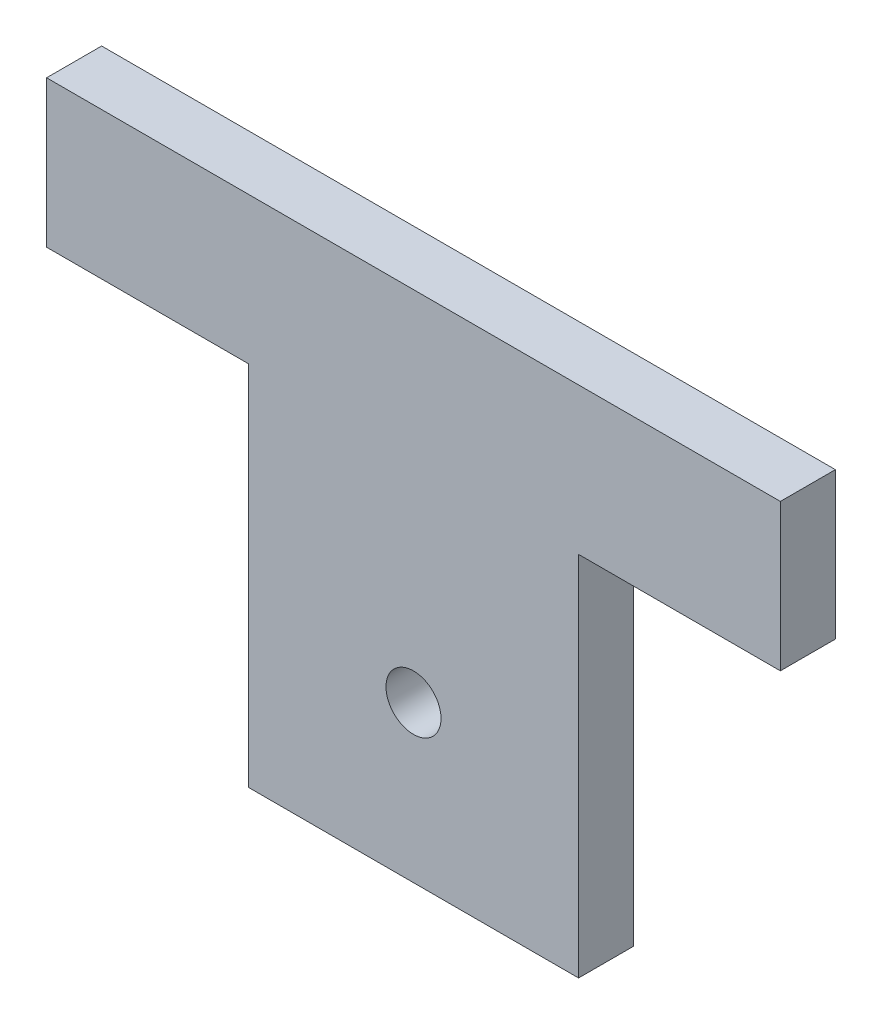
ISO-10303-21;
HEADER;
FILE_DESCRIPTION(('STEP AP214'),'2;1');
FILE_NAME('part.step','',(''),(''),'','','');
FILE_SCHEMA(('AUTOMOTIVE_DESIGN { 1 0 10303 214 1 1 1 1 }'));
ENDSEC;
DATA;
#1=APPLICATION_CONTEXT('core data for automotive mechanical design processes');
#2=APPLICATION_PROTOCOL_DEFINITION('international standard','automotive_design',2000,#1);
#3=PRODUCT_CONTEXT('',#1,'mechanical');
#4=PRODUCT('Part','Part','',(#3));
#5=PRODUCT_RELATED_PRODUCT_CATEGORY('part','',(#4));
#6=PRODUCT_DEFINITION_FORMATION('','',#4);
#7=PRODUCT_DEFINITION_CONTEXT('part definition',#1,'design');
#8=PRODUCT_DEFINITION('design','',#6,#7);
#9=PRODUCT_DEFINITION_SHAPE('','',#8);
#10=(LENGTH_UNIT() NAMED_UNIT(*) SI_UNIT(.MILLI.,.METRE.));
#11=(NAMED_UNIT(*) PLANE_ANGLE_UNIT() SI_UNIT($,.RADIAN.));
#12=(NAMED_UNIT(*) SI_UNIT($,.STERADIAN.) SOLID_ANGLE_UNIT());
#13=UNCERTAINTY_MEASURE_WITH_UNIT(LENGTH_MEASURE(1.E-05),#10,'distance_accuracy_value','');
#14=(GEOMETRIC_REPRESENTATION_CONTEXT(3) GLOBAL_UNCERTAINTY_ASSIGNED_CONTEXT((#13)) GLOBAL_UNIT_ASSIGNED_CONTEXT((#10,
#11,#12)) REPRESENTATION_CONTEXT('',''));
#15=CARTESIAN_POINT('',(0.,0.,0.));
#16=DIRECTION('',(0.,0.,1.));
#17=DIRECTION('',(1.,0.,0.));
#18=AXIS2_PLACEMENT_3D('',#15,#16,#17);
#19=CARTESIAN_POINT('',(0.,0.,3.));
#20=DIRECTION('',(0.,0.,1.));
#21=DIRECTION('',(1.,0.,0.));
#22=AXIS2_PLACEMENT_3D('',#19,#20,#21);
#23=PLANE('',#22);
#24=DIRECTION('',(0.,1.,0.));
#25=VECTOR('',#24,1.);
#26=CARTESIAN_POINT('',(9.00000000000001,0.,3.));
#27=LINE('',#26,#25);
#28=CARTESIAN_POINT('',(9.,-20.,3.));
#29=VERTEX_POINT('',#28);
#30=CARTESIAN_POINT('',(9.00000000000001,0.,3.));
#31=VERTEX_POINT('',#30);
#32=EDGE_CURVE('E145',#29,#31,#27,.T.);
#33=ORIENTED_EDGE('',*,*,#32,.T.);
#34=DIRECTION('',(1.,0.,0.));
#35=VECTOR('',#34,1.);
#36=CARTESIAN_POINT('',(20.,0.,3.));
#37=LINE('',#36,#35);
#38=CARTESIAN_POINT('',(20.,0.,3.));
#39=VERTEX_POINT('',#38);
#40=EDGE_CURVE('E93',#31,#39,#37,.T.);
#41=ORIENTED_EDGE('',*,*,#40,.T.);
#42=DIRECTION('',(0.,1.,0.));
#43=VECTOR('',#42,1.);
#44=CARTESIAN_POINT('',(20.,8.,3.));
#45=LINE('',#44,#43);
#46=CARTESIAN_POINT('',(20.,8.,3.));
#47=VERTEX_POINT('',#46);
#48=EDGE_CURVE('E160',#39,#47,#45,.T.);
#49=ORIENTED_EDGE('',*,*,#48,.T.);
#50=DIRECTION('',(-1.,0.,0.));
#51=VECTOR('',#50,1.);
#52=CARTESIAN_POINT('',(20.,8.,3.));
#53=LINE('',#52,#51);
#54=CARTESIAN_POINT('',(-20.,7.99999999999999,3.));
#55=VERTEX_POINT('',#54);
#56=EDGE_CURVE('E173',#47,#55,#53,.T.);
#57=ORIENTED_EDGE('',*,*,#56,.T.);
#58=DIRECTION('',(0.,-1.,0.));
#59=VECTOR('',#58,1.);
#60=CARTESIAN_POINT('',(-20.,7.99999999999999,3.));
#61=LINE('',#60,#59);
#62=CARTESIAN_POINT('',(-20.,0.,3.));
#63=VERTEX_POINT('',#62);
#64=EDGE_CURVE('E112',#55,#63,#61,.T.);
#65=ORIENTED_EDGE('',*,*,#64,.T.);
#66=DIRECTION('',(1.,0.,0.));
#67=VECTOR('',#66,1.);
#68=CARTESIAN_POINT('',(-20.,0.,3.));
#69=LINE('',#68,#67);
#70=CARTESIAN_POINT('',(-9.,0.,3.));
#71=VERTEX_POINT('',#70);
#72=EDGE_CURVE('E106',#63,#71,#69,.T.);
#73=ORIENTED_EDGE('',*,*,#72,.T.);
#74=DIRECTION('',(0.,-1.,0.));
#75=VECTOR('',#74,1.);
#76=CARTESIAN_POINT('',(-9.,0.,3.));
#77=LINE('',#76,#75);
#78=CARTESIAN_POINT('',(-9.,-20.,3.));
#79=VERTEX_POINT('',#78);
#80=EDGE_CURVE('E110',#71,#79,#77,.T.);
#81=ORIENTED_EDGE('',*,*,#80,.T.);
#82=DIRECTION('',(1.,0.,0.));
#83=VECTOR('',#82,1.);
#84=CARTESIAN_POINT('',(-9.,-20.,3.));
#85=LINE('',#84,#83);
#86=EDGE_CURVE('E50',#79,#29,#85,.T.);
#87=ORIENTED_EDGE('',*,*,#86,.T.);
#88=EDGE_LOOP('',(#33,#41,#49,#57,#65,#73,#81,#87));
#89=FACE_BOUND('',#88,.T.);
#90=CARTESIAN_POINT('',(0.,-11.5,3.));
#91=DIRECTION('',(0.,0.,1.));
#92=DIRECTION('',(1.,0.,0.));
#93=AXIS2_PLACEMENT_3D('',#90,#91,#92);
#94=CIRCLE('',#93,1.5);
#95=CARTESIAN_POINT('',(1.50000000000001,-11.5,3.));
#96=VERTEX_POINT('',#95);
#97=EDGE_CURVE('E134',#96,#96,#94,.T.);
#98=ORIENTED_EDGE('',*,*,#97,.F.);
#99=EDGE_LOOP('',(#98));
#100=FACE_BOUND('',#99,.T.);
#101=ADVANCED_FACE('F33',(#89,#100),#23,.T.);
#102=CARTESIAN_POINT('',(0.,0.,0.));
#103=DIRECTION('',(0.,0.,1.));
#104=DIRECTION('',(1.,0.,0.));
#105=AXIS2_PLACEMENT_3D('',#102,#103,#104);
#106=PLANE('',#105);
#107=DIRECTION('',(0.,1.,0.));
#108=VECTOR('',#107,1.);
#109=CARTESIAN_POINT('',(9.00000000000001,0.,0.));
#110=LINE('',#109,#108);
#111=CARTESIAN_POINT('',(9.,-20.,0.));
#112=VERTEX_POINT('',#111);
#113=CARTESIAN_POINT('',(9.00000000000001,0.,0.));
#114=VERTEX_POINT('',#113);
#115=EDGE_CURVE('E130',#112,#114,#110,.T.);
#116=ORIENTED_EDGE('',*,*,#115,.F.);
#117=DIRECTION('',(1.,0.,0.));
#118=VECTOR('',#117,1.);
#119=CARTESIAN_POINT('',(-9.,-20.,0.));
#120=LINE('',#119,#118);
#121=CARTESIAN_POINT('',(-9.,-20.,0.));
#122=VERTEX_POINT('',#121);
#123=EDGE_CURVE('E85',#122,#112,#120,.T.);
#124=ORIENTED_EDGE('',*,*,#123,.F.);
#125=DIRECTION('',(0.,-1.,0.));
#126=VECTOR('',#125,1.);
#127=CARTESIAN_POINT('',(-9.,0.,0.));
#128=LINE('',#127,#126);
#129=CARTESIAN_POINT('',(-9.,0.,0.));
#130=VERTEX_POINT('',#129);
#131=EDGE_CURVE('E79',#130,#122,#128,.T.);
#132=ORIENTED_EDGE('',*,*,#131,.F.);
#133=DIRECTION('',(1.,0.,0.));
#134=VECTOR('',#133,1.);
#135=CARTESIAN_POINT('',(-20.,0.,0.));
#136=LINE('',#135,#134);
#137=CARTESIAN_POINT('',(-20.,0.,0.));
#138=VERTEX_POINT('',#137);
#139=EDGE_CURVE('E120',#138,#130,#136,.T.);
#140=ORIENTED_EDGE('',*,*,#139,.F.);
#141=DIRECTION('',(0.,-1.,0.));
#142=VECTOR('',#141,1.);
#143=CARTESIAN_POINT('',(-20.,7.99999999999999,0.));
#144=LINE('',#143,#142);
#145=CARTESIAN_POINT('',(-20.,7.99999999999999,0.));
#146=VERTEX_POINT('',#145);
#147=EDGE_CURVE('E140',#146,#138,#144,.T.);
#148=ORIENTED_EDGE('',*,*,#147,.F.);
#149=DIRECTION('',(-1.,0.,0.));
#150=VECTOR('',#149,1.);
#151=CARTESIAN_POINT('',(20.,8.,0.));
#152=LINE('',#151,#150);
#153=CARTESIAN_POINT('',(20.,8.,0.));
#154=VERTEX_POINT('',#153);
#155=EDGE_CURVE('E138',#154,#146,#152,.T.);
#156=ORIENTED_EDGE('',*,*,#155,.F.);
#157=DIRECTION('',(0.,1.,0.));
#158=VECTOR('',#157,1.);
#159=CARTESIAN_POINT('',(20.,8.,0.));
#160=LINE('',#159,#158);
#161=CARTESIAN_POINT('',(20.,0.,0.));
#162=VERTEX_POINT('',#161);
#163=EDGE_CURVE('E136',#162,#154,#160,.T.);
#164=ORIENTED_EDGE('',*,*,#163,.F.);
#165=DIRECTION('',(1.,0.,0.));
#166=VECTOR('',#165,1.);
#167=CARTESIAN_POINT('',(20.,0.,0.));
#168=LINE('',#167,#166);
#169=EDGE_CURVE('E133',#114,#162,#168,.T.);
#170=ORIENTED_EDGE('',*,*,#169,.F.);
#171=EDGE_LOOP('',(#116,#124,#132,#140,#148,#156,#164,#170));
#172=FACE_BOUND('',#171,.T.);
#173=CARTESIAN_POINT('',(0.,-11.5,0.));
#174=DIRECTION('',(0.,0.,1.));
#175=DIRECTION('',(1.,0.,0.));
#176=AXIS2_PLACEMENT_3D('',#173,#174,#175);
#177=CIRCLE('',#176,1.5);
#178=CARTESIAN_POINT('',(1.50000000000001,-11.5,0.));
#179=VERTEX_POINT('',#178);
#180=EDGE_CURVE('E179',#179,#179,#177,.T.);
#181=ORIENTED_EDGE('',*,*,#180,.T.);
#182=EDGE_LOOP('',(#181));
#183=FACE_BOUND('',#182,.T.);
#184=ADVANCED_FACE('F164',(#172,#183),#106,.F.);
#185=CARTESIAN_POINT('',(9.00000000000001,0.,3.));
#186=DIRECTION('',(-1.,0.,0.));
#187=DIRECTION('',(0.,-1.,0.));
#188=AXIS2_PLACEMENT_3D('',#185,#186,#187);
#189=PLANE('',#188);
#190=ORIENTED_EDGE('',*,*,#115,.T.);
#191=DIRECTION('',(0.,0.,-1.));
#192=VECTOR('',#191,1.);
#193=CARTESIAN_POINT('',(9.00000000000001,0.,3.));
#194=LINE('',#193,#192);
#195=EDGE_CURVE('E11',#31,#114,#194,.T.);
#196=ORIENTED_EDGE('',*,*,#195,.F.);
#197=ORIENTED_EDGE('',*,*,#32,.F.);
#198=DIRECTION('',(0.,0.,-1.));
#199=VECTOR('',#198,1.);
#200=CARTESIAN_POINT('',(9.,-20.,3.));
#201=LINE('',#200,#199);
#202=EDGE_CURVE('E126',#29,#112,#201,.T.);
#203=ORIENTED_EDGE('',*,*,#202,.T.);
#204=EDGE_LOOP('',(#190,#196,#197,#203));
#205=FACE_BOUND('',#204,.T.);
#206=ADVANCED_FACE('F35',(#205),#189,.F.);
#207=CARTESIAN_POINT('',(20.,0.,3.));
#208=DIRECTION('',(0.,1.,0.));
#209=DIRECTION('',(-1.,0.,0.));
#210=AXIS2_PLACEMENT_3D('',#207,#208,#209);
#211=PLANE('',#210);
#212=ORIENTED_EDGE('',*,*,#169,.T.);
#213=DIRECTION('',(0.,0.,-1.));
#214=VECTOR('',#213,1.);
#215=CARTESIAN_POINT('',(20.,0.,3.));
#216=LINE('',#215,#214);
#217=EDGE_CURVE('E42',#39,#162,#216,.T.);
#218=ORIENTED_EDGE('',*,*,#217,.F.);
#219=ORIENTED_EDGE('',*,*,#40,.F.);
#220=ORIENTED_EDGE('',*,*,#195,.T.);
#221=EDGE_LOOP('',(#212,#218,#219,#220));
#222=FACE_BOUND('',#221,.T.);
#223=ADVANCED_FACE('F207',(#222),#211,.F.);
#224=CARTESIAN_POINT('',(20.,8.,3.));
#225=DIRECTION('',(-1.,0.,0.));
#226=DIRECTION('',(0.,-1.,0.));
#227=AXIS2_PLACEMENT_3D('',#224,#225,#226);
#228=PLANE('',#227);
#229=ORIENTED_EDGE('',*,*,#163,.T.);
#230=DIRECTION('',(0.,0.,-1.));
#231=VECTOR('',#230,1.);
#232=CARTESIAN_POINT('',(20.,8.,3.));
#233=LINE('',#232,#231);
#234=EDGE_CURVE('E152',#47,#154,#233,.T.);
#235=ORIENTED_EDGE('',*,*,#234,.F.);
#236=ORIENTED_EDGE('',*,*,#48,.F.);
#237=ORIENTED_EDGE('',*,*,#217,.T.);
#238=EDGE_LOOP('',(#229,#235,#236,#237));
#239=FACE_BOUND('',#238,.T.);
#240=ADVANCED_FACE('F158',(#239),#228,.F.);
#241=CARTESIAN_POINT('',(20.,8.,3.));
#242=DIRECTION('',(0.,-1.,0.));
#243=DIRECTION('',(1.,0.,0.));
#244=AXIS2_PLACEMENT_3D('',#241,#242,#243);
#245=PLANE('',#244);
#246=ORIENTED_EDGE('',*,*,#155,.T.);
#247=DIRECTION('',(0.,0.,-1.));
#248=VECTOR('',#247,1.);
#249=CARTESIAN_POINT('',(-20.,7.99999999999999,3.));
#250=LINE('',#249,#248);
#251=EDGE_CURVE('E149',#55,#146,#250,.T.);
#252=ORIENTED_EDGE('',*,*,#251,.F.);
#253=ORIENTED_EDGE('',*,*,#56,.F.);
#254=ORIENTED_EDGE('',*,*,#234,.T.);
#255=EDGE_LOOP('',(#246,#252,#253,#254));
#256=FACE_BOUND('',#255,.T.);
#257=ADVANCED_FACE('F169',(#256),#245,.F.);
#258=CARTESIAN_POINT('',(-20.,7.99999999999999,3.));
#259=DIRECTION('',(1.,0.,0.));
#260=DIRECTION('',(0.,1.,0.));
#261=AXIS2_PLACEMENT_3D('',#258,#259,#260);
#262=PLANE('',#261);
#263=ORIENTED_EDGE('',*,*,#147,.T.);
#264=DIRECTION('',(0.,0.,-1.));
#265=VECTOR('',#264,1.);
#266=CARTESIAN_POINT('',(-20.,0.,3.));
#267=LINE('',#266,#265);
#268=EDGE_CURVE('E121',#63,#138,#267,.T.);
#269=ORIENTED_EDGE('',*,*,#268,.F.);
#270=ORIENTED_EDGE('',*,*,#64,.F.);
#271=ORIENTED_EDGE('',*,*,#251,.T.);
#272=EDGE_LOOP('',(#263,#269,#270,#271));
#273=FACE_BOUND('',#272,.T.);
#274=ADVANCED_FACE('F172',(#273),#262,.F.);
#275=CARTESIAN_POINT('',(-20.,0.,3.));
#276=DIRECTION('',(0.,1.,0.));
#277=DIRECTION('',(-1.,0.,0.));
#278=AXIS2_PLACEMENT_3D('',#275,#276,#277);
#279=PLANE('',#278);
#280=ORIENTED_EDGE('',*,*,#139,.T.);
#281=DIRECTION('',(0.,0.,-1.));
#282=VECTOR('',#281,1.);
#283=CARTESIAN_POINT('',(-9.,0.,3.));
#284=LINE('',#283,#282);
#285=EDGE_CURVE('E117',#71,#130,#284,.T.);
#286=ORIENTED_EDGE('',*,*,#285,.F.);
#287=ORIENTED_EDGE('',*,*,#72,.F.);
#288=ORIENTED_EDGE('',*,*,#268,.T.);
#289=EDGE_LOOP('',(#280,#286,#287,#288));
#290=FACE_BOUND('',#289,.T.);
#291=ADVANCED_FACE('F118',(#290),#279,.F.);
#292=CARTESIAN_POINT('',(-9.,0.,3.));
#293=DIRECTION('',(1.,0.,0.));
#294=DIRECTION('',(0.,1.,0.));
#295=AXIS2_PLACEMENT_3D('',#292,#293,#294);
#296=PLANE('',#295);
#297=ORIENTED_EDGE('',*,*,#131,.T.);
#298=DIRECTION('',(0.,0.,-1.));
#299=VECTOR('',#298,1.);
#300=CARTESIAN_POINT('',(-9.,-20.,3.));
#301=LINE('',#300,#299);
#302=EDGE_CURVE('E122',#79,#122,#301,.T.);
#303=ORIENTED_EDGE('',*,*,#302,.F.);
#304=ORIENTED_EDGE('',*,*,#80,.F.);
#305=ORIENTED_EDGE('',*,*,#285,.T.);
#306=EDGE_LOOP('',(#297,#303,#304,#305));
#307=FACE_BOUND('',#306,.T.);
#308=ADVANCED_FACE('F124',(#307),#296,.F.);
#309=CARTESIAN_POINT('',(-9.,-20.,3.));
#310=DIRECTION('',(0.,1.,0.));
#311=DIRECTION('',(-1.,0.,0.));
#312=AXIS2_PLACEMENT_3D('',#309,#310,#311);
#313=PLANE('',#312);
#314=ORIENTED_EDGE('',*,*,#123,.T.);
#315=ORIENTED_EDGE('',*,*,#202,.F.);
#316=ORIENTED_EDGE('',*,*,#86,.F.);
#317=ORIENTED_EDGE('',*,*,#302,.T.);
#318=EDGE_LOOP('',(#314,#315,#316,#317));
#319=FACE_BOUND('',#318,.T.);
#320=ADVANCED_FACE('F195',(#319),#313,.F.);
#321=CARTESIAN_POINT('',(0.,-11.5,3.));
#322=DIRECTION('',(0.,0.,-1.));
#323=DIRECTION('',(-1.,0.,0.));
#324=AXIS2_PLACEMENT_3D('',#321,#322,#323);
#325=CYLINDRICAL_SURFACE('',#324,1.5);
#326=ORIENTED_EDGE('',*,*,#97,.T.);
#327=EDGE_LOOP('',(#326));
#328=FACE_BOUND('',#327,.T.);
#329=ORIENTED_EDGE('',*,*,#180,.F.);
#330=EDGE_LOOP('',(#329));
#331=FACE_BOUND('',#330,.T.);
#332=ADVANCED_FACE('F185',(#328,#331),#325,.F.);
#333=CLOSED_SHELL('',(#101,#184,#206,#223,#240,#257,#274,#291,#308,#320,#332));
#334=MANIFOLD_SOLID_BREP('B2',#333);
#335=ADVANCED_BREP_SHAPE_REPRESENTATION('',(#18,#334),#14);
#336=SHAPE_DEFINITION_REPRESENTATION(#9,#335);
ENDSEC;
END-ISO-10303-21;
